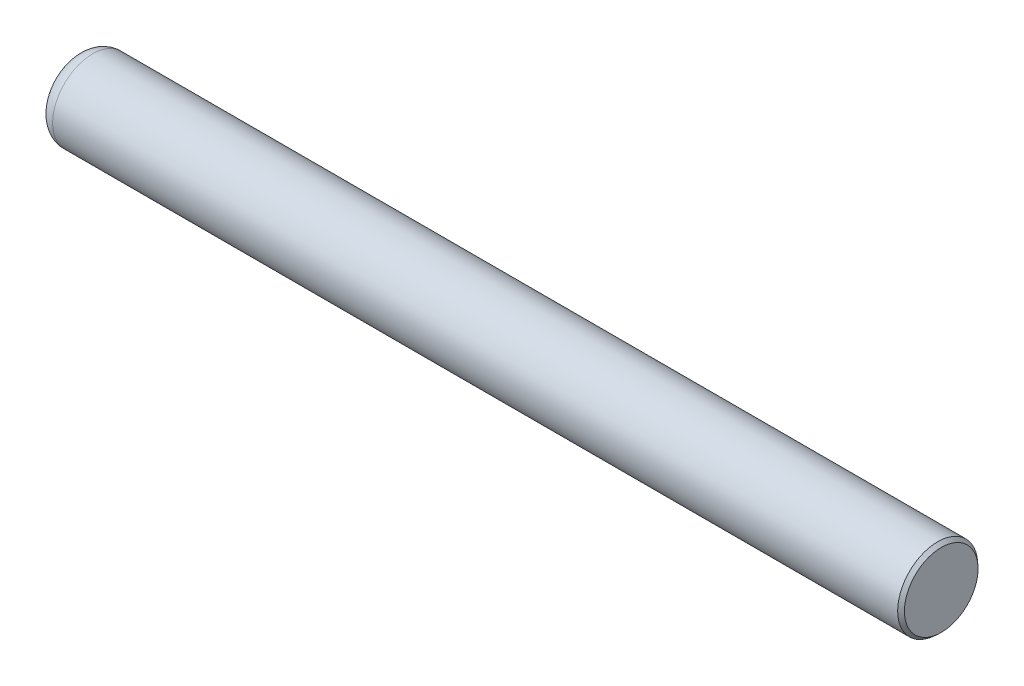
ISO-10303-21;
HEADER;
FILE_DESCRIPTION(('STEP AP214'),'2;1');
FILE_NAME('part.step','',(''),(''),'','','');
FILE_SCHEMA(('AUTOMOTIVE_DESIGN { 1 0 10303 214 1 1 1 1 }'));
ENDSEC;
DATA;
#1=APPLICATION_CONTEXT('core data for automotive mechanical design processes');
#2=APPLICATION_PROTOCOL_DEFINITION('international standard','automotive_design',2000,#1);
#3=PRODUCT_CONTEXT('',#1,'mechanical');
#4=PRODUCT('Part','Part','',(#3));
#5=PRODUCT_RELATED_PRODUCT_CATEGORY('part','',(#4));
#6=PRODUCT_DEFINITION_FORMATION('','',#4);
#7=PRODUCT_DEFINITION_CONTEXT('part definition',#1,'design');
#8=PRODUCT_DEFINITION('design','',#6,#7);
#9=PRODUCT_DEFINITION_SHAPE('','',#8);
#10=(LENGTH_UNIT() NAMED_UNIT(*) SI_UNIT(.MILLI.,.METRE.));
#11=(NAMED_UNIT(*) PLANE_ANGLE_UNIT() SI_UNIT($,.RADIAN.));
#12=(NAMED_UNIT(*) SI_UNIT($,.STERADIAN.) SOLID_ANGLE_UNIT());
#13=UNCERTAINTY_MEASURE_WITH_UNIT(LENGTH_MEASURE(1.E-05),#10,'distance_accuracy_value','');
#14=(GEOMETRIC_REPRESENTATION_CONTEXT(3) GLOBAL_UNCERTAINTY_ASSIGNED_CONTEXT((#13)) GLOBAL_UNIT_ASSIGNED_CONTEXT((#10,
#11,#12)) REPRESENTATION_CONTEXT('',''));
#15=CARTESIAN_POINT('',(0.,0.,0.));
#16=DIRECTION('',(0.,0.,1.));
#17=DIRECTION('',(1.,0.,0.));
#18=AXIS2_PLACEMENT_3D('',#15,#16,#17);
#19=CARTESIAN_POINT('',(540.,25.,0.));
#20=DIRECTION('',(-1.,0.,0.));
#21=DIRECTION('',(0.,0.,1.));
#22=AXIS2_PLACEMENT_3D('',#19,#20,#21);
#23=PLANE('',#22);
#24=CARTESIAN_POINT('',(540.,25.,0.));
#25=DIRECTION('',(-1.,0.,0.));
#26=DIRECTION('',(0.,0.,1.));
#27=AXIS2_PLACEMENT_3D('',#24,#25,#26);
#28=CIRCLE('',#27,23.0000000000002);
#29=CARTESIAN_POINT('',(540.,25.,23.0000000000002));
#30=VERTEX_POINT('',#29);
#31=EDGE_CURVE('E42',#30,#30,#28,.F.);
#32=ORIENTED_EDGE('',*,*,#31,.T.);
#33=EDGE_LOOP('',(#32));
#34=FACE_BOUND('',#33,.T.);
#35=ADVANCED_FACE('F31',(#34),#23,.F.);
#36=CARTESIAN_POINT('',(0.,25.,0.));
#37=DIRECTION('',(1.,0.,0.));
#38=DIRECTION('',(0.,0.,-1.));
#39=AXIS2_PLACEMENT_3D('',#36,#37,#38);
#40=PLANE('',#39);
#41=CARTESIAN_POINT('',(0.,25.,0.));
#42=DIRECTION('',(1.,0.,0.));
#43=DIRECTION('',(0.,0.,-1.));
#44=AXIS2_PLACEMENT_3D('',#41,#42,#43);
#45=CIRCLE('',#44,15.);
#46=CARTESIAN_POINT('',(0.,25.,-15.));
#47=VERTEX_POINT('',#46);
#48=EDGE_CURVE('E38',#47,#47,#45,.F.);
#49=ORIENTED_EDGE('',*,*,#48,.T.);
#50=EDGE_LOOP('',(#49));
#51=FACE_BOUND('',#50,.T.);
#52=ADVANCED_FACE('F62',(#51),#40,.F.);
#53=CARTESIAN_POINT('',(0.,25.,0.));
#54=DIRECTION('',(-1.,0.,0.));
#55=DIRECTION('',(0.,0.,1.));
#56=AXIS2_PLACEMENT_3D('',#53,#54,#55);
#57=CYLINDRICAL_SURFACE('',#56,25.);
#58=CARTESIAN_POINT('',(10.,25.,0.));
#59=DIRECTION('',(1.,0.,0.));
#60=DIRECTION('',(0.,0.,-1.));
#61=AXIS2_PLACEMENT_3D('',#58,#59,#60);
#62=CIRCLE('',#61,25.);
#63=CARTESIAN_POINT('',(10.,25.,-25.));
#64=VERTEX_POINT('',#63);
#65=EDGE_CURVE('E10',#64,#64,#62,.T.);
#66=ORIENTED_EDGE('',*,*,#65,.T.);
#67=EDGE_LOOP('',(#66));
#68=FACE_BOUND('',#67,.T.);
#69=CARTESIAN_POINT('',(537.778774970342,25.,0.));
#70=DIRECTION('',(-1.,0.,0.));
#71=DIRECTION('',(0.,0.,1.));
#72=AXIS2_PLACEMENT_3D('',#69,#70,#71);
#73=CIRCLE('',#72,25.);
#74=CARTESIAN_POINT('',(537.778774970342,25.,25.));
#75=VERTEX_POINT('',#74);
#76=EDGE_CURVE('E46',#75,#75,#73,.T.);
#77=ORIENTED_EDGE('',*,*,#76,.T.);
#78=EDGE_LOOP('',(#77));
#79=FACE_BOUND('',#78,.T.);
#80=ADVANCED_FACE('F52',(#68,#79),#57,.T.);
#81=CARTESIAN_POINT('',(537.778774970342,25.,0.));
#82=DIRECTION('',(-1.,0.,0.));
#83=DIRECTION('',(0.,0.,1.));
#84=AXIS2_PLACEMENT_3D('',#81,#82,#83);
#85=CONICAL_SURFACE('',#84,25.,0.733038285837622);
#86=ORIENTED_EDGE('',*,*,#31,.F.);
#87=EDGE_LOOP('',(#86));
#88=FACE_BOUND('',#87,.T.);
#89=ORIENTED_EDGE('',*,*,#76,.F.);
#90=EDGE_LOOP('',(#89));
#91=FACE_BOUND('',#90,.T.);
#92=ADVANCED_FACE('F54',(#88,#91),#85,.T.);
#93=CARTESIAN_POINT('',(10.,25.,0.));
#94=DIRECTION('',(1.,0.,0.));
#95=DIRECTION('',(0.,0.,-1.));
#96=AXIS2_PLACEMENT_3D('',#93,#94,#95);
#97=TOROIDAL_SURFACE('',#96,15.,10.);
#98=ORIENTED_EDGE('',*,*,#65,.F.);
#99=EDGE_LOOP('',(#98));
#100=FACE_BOUND('',#99,.T.);
#101=ORIENTED_EDGE('',*,*,#48,.F.);
#102=EDGE_LOOP('',(#101));
#103=FACE_BOUND('',#102,.T.);
#104=ADVANCED_FACE('F33',(#100,#103),#97,.T.);
#105=CLOSED_SHELL('',(#35,#52,#80,#92,#104));
#106=MANIFOLD_SOLID_BREP('B2',#105);
#107=ADVANCED_BREP_SHAPE_REPRESENTATION('',(#18,#106),#14);
#108=SHAPE_DEFINITION_REPRESENTATION(#9,#107);
ENDSEC;
END-ISO-10303-21;
